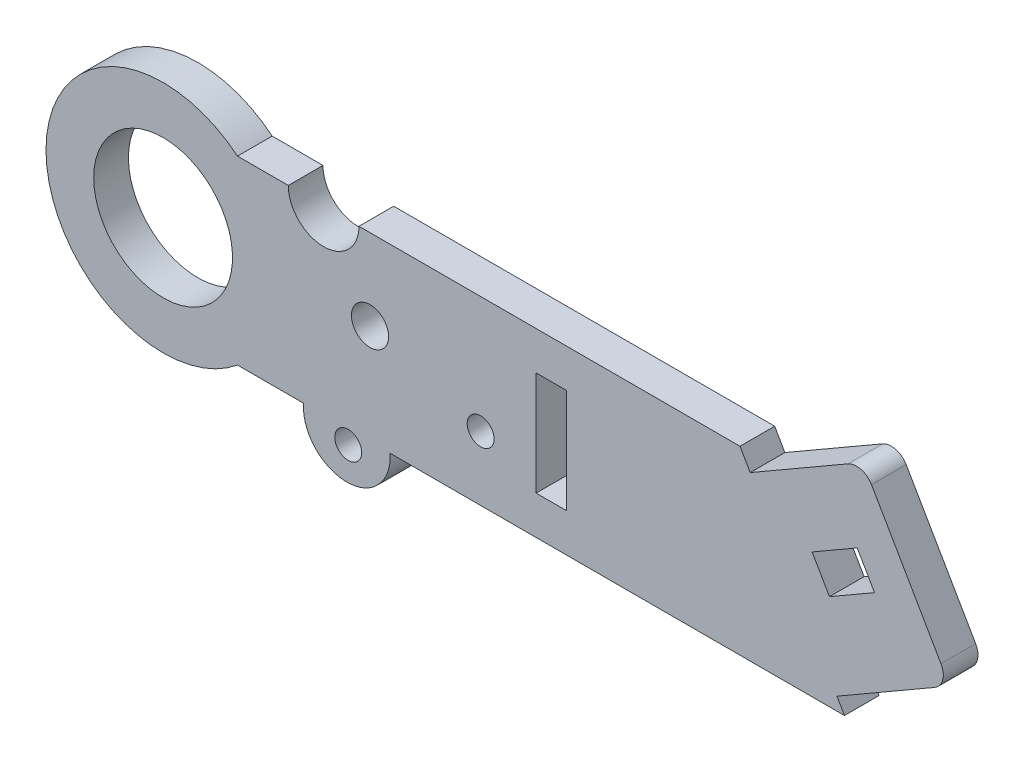
ISO-10303-21;
HEADER;
FILE_DESCRIPTION(('STEP AP214'),'2;1');
FILE_NAME('part.step','',(''),(''),'','','');
FILE_SCHEMA(('AUTOMOTIVE_DESIGN { 1 0 10303 214 1 1 1 1 }'));
ENDSEC;
DATA;
#1=APPLICATION_CONTEXT('core data for automotive mechanical design processes');
#2=APPLICATION_PROTOCOL_DEFINITION('international standard','automotive_design',2000,#1);
#3=PRODUCT_CONTEXT('',#1,'mechanical');
#4=PRODUCT('Part','Part','',(#3));
#5=PRODUCT_RELATED_PRODUCT_CATEGORY('part','',(#4));
#6=PRODUCT_DEFINITION_FORMATION('','',#4);
#7=PRODUCT_DEFINITION_CONTEXT('part definition',#1,'design');
#8=PRODUCT_DEFINITION('design','',#6,#7);
#9=PRODUCT_DEFINITION_SHAPE('','',#8);
#10=(LENGTH_UNIT() NAMED_UNIT(*) SI_UNIT(.MILLI.,.METRE.));
#11=(NAMED_UNIT(*) PLANE_ANGLE_UNIT() SI_UNIT($,.RADIAN.));
#12=(NAMED_UNIT(*) SI_UNIT($,.STERADIAN.) SOLID_ANGLE_UNIT());
#13=UNCERTAINTY_MEASURE_WITH_UNIT(LENGTH_MEASURE(1.E-05),#10,'distance_accuracy_value','');
#14=(GEOMETRIC_REPRESENTATION_CONTEXT(3) GLOBAL_UNCERTAINTY_ASSIGNED_CONTEXT((#13)) GLOBAL_UNIT_ASSIGNED_CONTEXT((#10,
#11,#12)) REPRESENTATION_CONTEXT('',''));
#15=CARTESIAN_POINT('',(0.,0.,0.));
#16=DIRECTION('',(0.,0.,1.));
#17=DIRECTION('',(1.,0.,0.));
#18=AXIS2_PLACEMENT_3D('',#15,#16,#17);
#19=CARTESIAN_POINT('',(8.57055073223616,-10.430515814004,4.));
#20=DIRECTION('',(0.,1.,0.));
#21=DIRECTION('',(0.,0.,1.));
#22=AXIS2_PLACEMENT_3D('',#19,#20,#21);
#23=PLANE('',#22);
#24=DIRECTION('',(1.,0.,0.));
#25=VECTOR('',#24,1.);
#26=CARTESIAN_POINT('',(8.57055073223616,-10.430515814004,0.));
#27=LINE('',#26,#25);
#28=CARTESIAN_POINT('',(-71.4294492677641,-10.4305158140037,0.));
#29=VERTEX_POINT('',#28);
#30=CARTESIAN_POINT('',(-63.8116781778458,-10.4305158140037,0.));
#31=VERTEX_POINT('',#30);
#32=EDGE_CURVE('E189',#29,#31,#27,.T.);
#33=ORIENTED_EDGE('',*,*,#32,.T.);
#34=DIRECTION('',(0.,0.,1.));
#35=VECTOR('',#34,1.);
#36=CARTESIAN_POINT('',(-63.8116781778458,-10.4305158140037,-11.3544340451003));
#37=LINE('',#36,#35);
#38=CARTESIAN_POINT('',(-63.8116781778458,-10.4305158140037,4.));
#39=VERTEX_POINT('',#38);
#40=EDGE_CURVE('E193',#31,#39,#37,.T.);
#41=ORIENTED_EDGE('',*,*,#40,.T.);
#42=DIRECTION('',(1.,0.,0.));
#43=VECTOR('',#42,1.);
#44=CARTESIAN_POINT('',(8.57055073223616,-10.430515814004,4.));
#45=LINE('',#44,#43);
#46=CARTESIAN_POINT('',(-71.4294492677641,-10.4305158140037,4.));
#47=VERTEX_POINT('',#46);
#48=EDGE_CURVE('E216',#47,#39,#45,.T.);
#49=ORIENTED_EDGE('',*,*,#48,.F.);
#50=DIRECTION('',(0.,0.,-1.));
#51=VECTOR('',#50,1.);
#52=CARTESIAN_POINT('',(-71.4294492677641,-10.4305158140037,4.));
#53=LINE('',#52,#51);
#54=EDGE_CURVE('E205',#47,#29,#53,.T.);
#55=ORIENTED_EDGE('',*,*,#54,.T.);
#56=EDGE_LOOP('',(#33,#41,#49,#55));
#57=FACE_BOUND('',#56,.T.);
#58=ADVANCED_FACE('F33',(#57),#23,.F.);
#59=CARTESIAN_POINT('',(8.57055073223616,-2.22044604925031E-13,4.));
#60=DIRECTION('',(0.,0.,-1.));
#61=DIRECTION('',(-1.,0.,0.));
#62=AXIS2_PLACEMENT_3D('',#59,#60,#61);
#63=PLANE('',#62);
#64=CARTESIAN_POINT('',(-58.6598475020388,-12.0125477342129,4.));
#65=DIRECTION('',(0.,0.,1.));
#66=DIRECTION('',(1.,0.,0.));
#67=AXIS2_PLACEMENT_3D('',#64,#65,#66);
#68=CIRCLE('',#67,1.54999999999853);
#69=CARTESIAN_POINT('',(-57.1098475020402,-12.0125477342129,4.));
#70=VERTEX_POINT('',#69);
#71=EDGE_CURVE('E222',#70,#70,#68,.T.);
#72=ORIENTED_EDGE('',*,*,#71,.F.);
#73=EDGE_LOOP('',(#72));
#74=FACE_BOUND('',#73,.T.);
#75=CARTESIAN_POINT('',(-43.3999999999984,-3.02505635917277,4.));
#76=DIRECTION('',(0.,0.,1.));
#77=DIRECTION('',(1.,0.,0.));
#78=AXIS2_PLACEMENT_3D('',#75,#76,#77);
#79=CIRCLE('',#78,1.54999999999853);
#80=CARTESIAN_POINT('',(-41.8499999999999,-3.02505635917277,4.));
#81=VERTEX_POINT('',#80);
#82=EDGE_CURVE('E227',#81,#81,#79,.T.);
#83=ORIENTED_EDGE('',*,*,#82,.F.);
#84=EDGE_LOOP('',(#83));
#85=FACE_BOUND('',#84,.T.);
#86=CARTESIAN_POINT('',(-80.,0.,4.));
#87=DIRECTION('',(0.,0.,-1.));
#88=DIRECTION('',(-1.,0.,0.));
#89=AXIS2_PLACEMENT_3D('',#86,#87,#88);
#90=CIRCLE('',#89,8.);
#91=CARTESIAN_POINT('',(-88.,0.,4.));
#92=VERTEX_POINT('',#91);
#93=EDGE_CURVE('E322',#92,#92,#90,.T.);
#94=ORIENTED_EDGE('',*,*,#93,.T.);
#95=EDGE_LOOP('',(#94));
#96=FACE_BOUND('',#95,.T.);
#97=DIRECTION('',(0.866025403784436,0.500000000000004,0.));
#98=VECTOR('',#97,1.);
#99=CARTESIAN_POINT('',(-5.19615242270663,4.03358580113404,4.));
#100=LINE('',#99,#98);
#101=CARTESIAN_POINT('',(-5.19615242270664,4.03358580113404,4.));
#102=VERTEX_POINT('',#101);
#103=CARTESIAN_POINT('',(0.,7.03358580113407,4.));
#104=VERTEX_POINT('',#103);
#105=EDGE_CURVE('E356',#102,#104,#100,.T.);
#106=ORIENTED_EDGE('',*,*,#105,.T.);
#107=DIRECTION('',(0.500000000000028,-0.866025403784423,0.));
#108=VECTOR('',#107,1.);
#109=CARTESIAN_POINT('',(0.,7.03358580113407,4.));
#110=LINE('',#109,#108);
#111=CARTESIAN_POINT('',(2.,3.56948418599654,4.));
#112=VERTEX_POINT('',#111);
#113=EDGE_CURVE('E353',#104,#112,#110,.T.);
#114=ORIENTED_EDGE('',*,*,#113,.T.);
#115=DIRECTION('',(0.86602540378442,0.500000000000032,0.));
#116=VECTOR('',#115,1.);
#117=CARTESIAN_POINT('',(-3.19615242270662,0.569484185996294,4.));
#118=LINE('',#117,#116);
#119=CARTESIAN_POINT('',(-3.19615242270662,0.569484185996294,4.));
#120=VERTEX_POINT('',#119);
#121=EDGE_CURVE('E350',#120,#112,#118,.T.);
#122=ORIENTED_EDGE('',*,*,#121,.F.);
#123=DIRECTION('',(0.500000000000004,-0.866025403784436,0.));
#124=VECTOR('',#123,1.);
#125=CARTESIAN_POINT('',(-5.19615242270663,4.03358580113404,4.));
#126=LINE('',#125,#124);
#127=EDGE_CURVE('E347',#102,#120,#126,.T.);
#128=ORIENTED_EDGE('',*,*,#127,.F.);
#129=EDGE_LOOP('',(#106,#114,#122,#128));
#130=FACE_BOUND('',#129,.T.);
#131=CARTESIAN_POINT('',(-56.1528243140113,1.10586946070457,4.));
#132=DIRECTION('',(0.,0.,1.));
#133=DIRECTION('',(1.,0.,0.));
#134=AXIS2_PLACEMENT_3D('',#131,#132,#133);
#135=CIRCLE('',#134,2.14132169694266);
#136=CARTESIAN_POINT('',(-54.0115026170686,1.10586946070457,4.));
#137=VERTEX_POINT('',#136);
#138=EDGE_CURVE('E332',#137,#137,#135,.T.);
#139=ORIENTED_EDGE('',*,*,#138,.F.);
#140=EDGE_LOOP('',(#139));
#141=FACE_BOUND('',#140,.T.);
#142=CARTESIAN_POINT('',(-0.0717013090071193,13.1579965718949,4.));
#143=DIRECTION('',(0.,0.,-1.));
#144=DIRECTION('',(-1.,0.,0.));
#145=AXIS2_PLACEMENT_3D('',#142,#143,#144);
#146=CIRCLE('',#145,2.);
#147=CARTESIAN_POINT('',(-1.07179676972452,14.8899922616853,4.));
#148=VERTEX_POINT('',#147);
#149=CARTESIAN_POINT('',(1.64975511933884,14.1761261143925,4.));
#150=VERTEX_POINT('',#149);
#151=EDGE_CURVE('E265',#148,#150,#146,.T.);
#152=ORIENTED_EDGE('',*,*,#151,.F.);
#153=DIRECTION('',(0.866025403784438,0.500000000000001,0.));
#154=VECTOR('',#153,1.);
#155=CARTESIAN_POINT('',(-1.07179676972452,14.8899922616853,4.));
#156=LINE('',#155,#154);
#157=CARTESIAN_POINT('',(-12.3301270189222,8.3899922616853,4.));
#158=VERTEX_POINT('',#157);
#159=EDGE_CURVE('E274',#158,#148,#156,.T.);
#160=ORIENTED_EDGE('',*,*,#159,.F.);
#161=DIRECTION('',(0.499999999999999,-0.866025403784439,0.));
#162=VECTOR('',#161,1.);
#163=CARTESIAN_POINT('',(-15.6303737032397,14.1061871964339,4.));
#164=LINE('',#163,#162);
#165=CARTESIAN_POINT('',(-13.5082238411409,10.4305158140035,4.));
#166=VERTEX_POINT('',#165);
#167=EDGE_CURVE('E317',#166,#158,#164,.T.);
#168=ORIENTED_EDGE('',*,*,#167,.F.);
#169=DIRECTION('',(-1.,0.,0.));
#170=VECTOR('',#169,1.);
#171=CARTESIAN_POINT('',(-57.4234990357641,10.4305158140035,4.));
#172=LINE('',#171,#170);
#173=CARTESIAN_POINT('',(-57.4234990357641,10.4305158140035,4.));
#174=VERTEX_POINT('',#173);
#175=EDGE_CURVE('E206',#166,#174,#172,.T.);
#176=ORIENTED_EDGE('',*,*,#175,.T.);
#177=CARTESIAN_POINT('',(-61.4993944199049,10.430515814004,4.));
#178=DIRECTION('',(0.,0.,-1.));
#179=DIRECTION('',(1.,0.,0.));
#180=AXIS2_PLACEMENT_3D('',#177,#178,#179);
#181=CIRCLE('',#180,4.07589538414074);
#182=CARTESIAN_POINT('',(-65.5752898040456,10.430515814004,4.));
#183=VERTEX_POINT('',#182);
#184=EDGE_CURVE('E208',#174,#183,#181,.T.);
#185=ORIENTED_EDGE('',*,*,#184,.T.);
#186=DIRECTION('',(-1.,0.,0.));
#187=VECTOR('',#186,1.);
#188=CARTESIAN_POINT('',(-71.4294492677638,10.430515814004,4.));
#189=LINE('',#188,#187);
#190=CARTESIAN_POINT('',(-71.4294492677638,10.430515814004,4.));
#191=VERTEX_POINT('',#190);
#192=EDGE_CURVE('E366',#183,#191,#189,.T.);
#193=ORIENTED_EDGE('',*,*,#192,.T.);
#194=CARTESIAN_POINT('',(-80.0000000000002,4.8919202022546E-13,4.));
#195=DIRECTION('',(0.,0.,1.));
#196=DIRECTION('',(1.,0.,0.));
#197=AXIS2_PLACEMENT_3D('',#194,#195,#196);
#198=CIRCLE('',#197,13.5000000000009);
#199=EDGE_CURVE('E368',#191,#47,#198,.T.);
#200=ORIENTED_EDGE('',*,*,#199,.T.);
#201=ORIENTED_EDGE('',*,*,#48,.T.);
#202=CARTESIAN_POINT('',(-58.8259890857738,-10.8085426347376,4.));
#203=DIRECTION('',(0.,0.,1.));
#204=DIRECTION('',(1.,0.,0.));
#205=AXIS2_PLACEMENT_3D('',#202,#203,#204);
#206=CIRCLE('',#205,5.);
#207=CARTESIAN_POINT('',(-53.8402999937018,-10.4305158140037,4.));
#208=VERTEX_POINT('',#207);
#209=EDGE_CURVE('E198',#39,#208,#206,.T.);
#210=ORIENTED_EDGE('',*,*,#209,.T.);
#211=CARTESIAN_POINT('',(-1.46410161513748,-10.430515814004,4.));
#212=VERTEX_POINT('',#211);
#213=EDGE_CURVE('E370',#208,#212,#45,.T.);
#214=ORIENTED_EDGE('',*,*,#213,.T.);
#215=DIRECTION('',(0.5,-0.866025403784439,0.));
#216=VECTOR('',#215,1.);
#217=CARTESIAN_POINT('',(-2.33012701892221,-8.93051581400346,4.));
#218=LINE('',#217,#216);
#219=CARTESIAN_POINT('',(-2.33012701892221,-8.93051581400346,4.));
#220=VERTEX_POINT('',#219);
#221=EDGE_CURVE('E301',#220,#212,#218,.T.);
#222=ORIENTED_EDGE('',*,*,#221,.F.);
#223=DIRECTION('',(-0.866025403784438,-0.5,0.));
#224=VECTOR('',#223,1.);
#225=CARTESIAN_POINT('',(-2.33012701892221,-8.93051581400346,4.));
#226=LINE('',#225,#224);
#227=CARTESIAN_POINT('',(8.92820323027549,-2.43051581400346,4.));
#228=VERTEX_POINT('',#227);
#229=EDGE_CURVE('E298',#228,#220,#226,.T.);
#230=ORIENTED_EDGE('',*,*,#229,.F.);
#231=CARTESIAN_POINT('',(7.92820323027598,-0.6984650064343,4.));
#232=DIRECTION('',(0.,0.,-1.));
#233=DIRECTION('',(-1.,0.,0.));
#234=AXIS2_PLACEMENT_3D('',#231,#232,#233);
#235=CIRCLE('',#234,2.);
#236=CARTESIAN_POINT('',(9.66025478960577,0.301533691476469,4.));
#237=VERTEX_POINT('',#236);
#238=EDGE_CURVE('E272',#237,#228,#235,.T.);
#239=ORIENTED_EDGE('',*,*,#238,.F.);
#240=DIRECTION('',(0.5,-0.866025403784439,0.));
#241=VECTOR('',#240,1.);
#242=CARTESIAN_POINT('',(1.64975511933884,14.1761261143925,4.));
#243=LINE('',#242,#241);
#244=EDGE_CURVE('E268',#150,#237,#243,.T.);
#245=ORIENTED_EDGE('',*,*,#244,.F.);
#246=EDGE_LOOP('',(#152,#160,#168,#176,#185,#193,#200,#201,#210,#214,#222,#230,#239,#245));
#247=FACE_BOUND('',#246,.T.);
#248=DIRECTION('',(1.,0.,0.));
#249=VECTOR('',#248,1.);
#250=CARTESIAN_POINT('',(-37.008223841141,5.99999999999992,4.));
#251=LINE('',#250,#249);
#252=CARTESIAN_POINT('',(-37.008223841141,5.99999999999992,4.));
#253=VERTEX_POINT('',#252);
#254=CARTESIAN_POINT('',(-33.508223841141,6.00000000000007,4.));
#255=VERTEX_POINT('',#254);
#256=EDGE_CURVE('E58',#253,#255,#251,.T.);
#257=ORIENTED_EDGE('',*,*,#256,.T.);
#258=DIRECTION('',(0.,-1.,0.));
#259=VECTOR('',#258,1.);
#260=CARTESIAN_POINT('',(-33.508223841141,6.00000000000007,4.));
#261=LINE('',#260,#259);
#262=CARTESIAN_POINT('',(-33.508223841141,-5.99999999999993,4.));
#263=VERTEX_POINT('',#262);
#264=EDGE_CURVE('E244',#255,#263,#261,.T.);
#265=ORIENTED_EDGE('',*,*,#264,.T.);
#266=DIRECTION('',(1.,0.,0.));
#267=VECTOR('',#266,1.);
#268=CARTESIAN_POINT('',(-37.008223841141,-6.00000000000008,4.));
#269=LINE('',#268,#267);
#270=CARTESIAN_POINT('',(-37.008223841141,-6.00000000000008,4.));
#271=VERTEX_POINT('',#270);
#272=EDGE_CURVE('E247',#271,#263,#269,.T.);
#273=ORIENTED_EDGE('',*,*,#272,.F.);
#274=DIRECTION('',(0.,-1.,0.));
#275=VECTOR('',#274,1.);
#276=CARTESIAN_POINT('',(-37.008223841141,5.99999999999992,4.));
#277=LINE('',#276,#275);
#278=EDGE_CURVE('E250',#253,#271,#277,.T.);
#279=ORIENTED_EDGE('',*,*,#278,.F.);
#280=EDGE_LOOP('',(#257,#265,#273,#279));
#281=FACE_BOUND('',#280,.T.);
#282=ADVANCED_FACE('F392',(#74,#85,#96,#130,#141,#247,#281),#63,.F.);
#283=CARTESIAN_POINT('',(8.57055073223616,-2.22044604925031E-13,0.));
#284=DIRECTION('',(0.,0.,-1.));
#285=DIRECTION('',(-1.,0.,0.));
#286=AXIS2_PLACEMENT_3D('',#283,#284,#285);
#287=PLANE('',#286);
#288=CARTESIAN_POINT('',(-58.6598475020388,-12.0125477342129,0.));
#289=DIRECTION('',(0.,0.,-1.));
#290=DIRECTION('',(-1.,0.,0.));
#291=AXIS2_PLACEMENT_3D('',#288,#289,#290);
#292=CIRCLE('',#291,1.54999999999853);
#293=CARTESIAN_POINT('',(-60.2098475020373,-12.0125477342129,0.));
#294=VERTEX_POINT('',#293);
#295=EDGE_CURVE('E37',#294,#294,#292,.T.);
#296=ORIENTED_EDGE('',*,*,#295,.F.);
#297=EDGE_LOOP('',(#296));
#298=FACE_BOUND('',#297,.T.);
#299=CARTESIAN_POINT('',(-43.3999999999984,-3.02505635917277,0.));
#300=DIRECTION('',(0.,0.,-1.));
#301=DIRECTION('',(-1.,0.,0.));
#302=AXIS2_PLACEMENT_3D('',#299,#300,#301);
#303=CIRCLE('',#302,1.54999999999853);
#304=CARTESIAN_POINT('',(-44.9499999999969,-3.02505635917277,0.));
#305=VERTEX_POINT('',#304);
#306=EDGE_CURVE('E220',#305,#305,#303,.T.);
#307=ORIENTED_EDGE('',*,*,#306,.F.);
#308=EDGE_LOOP('',(#307));
#309=FACE_BOUND('',#308,.T.);
#310=DIRECTION('',(0.866025403784438,0.500000000000001,0.));
#311=VECTOR('',#310,1.);
#312=CARTESIAN_POINT('',(-1.07179676972452,14.8899922616853,0.));
#313=LINE('',#312,#311);
#314=CARTESIAN_POINT('',(-12.3301270189222,8.3899922616853,0.));
#315=VERTEX_POINT('',#314);
#316=CARTESIAN_POINT('',(-1.07179676972452,14.8899922616853,0.));
#317=VERTEX_POINT('',#316);
#318=EDGE_CURVE('E314',#315,#317,#313,.T.);
#319=ORIENTED_EDGE('',*,*,#318,.T.);
#320=CARTESIAN_POINT('',(-0.0717013090071193,13.1579965718949,0.));
#321=DIRECTION('',(0.,0.,1.));
#322=DIRECTION('',(-1.,0.,0.));
#323=AXIS2_PLACEMENT_3D('',#320,#321,#322);
#324=CIRCLE('',#323,2.);
#325=CARTESIAN_POINT('',(1.64975511933884,14.1761261143925,0.));
#326=VERTEX_POINT('',#325);
#327=EDGE_CURVE('E280',#326,#317,#324,.T.);
#328=ORIENTED_EDGE('',*,*,#327,.F.);
#329=DIRECTION('',(-0.5,0.866025403784439,0.));
#330=VECTOR('',#329,1.);
#331=CARTESIAN_POINT('',(1.64975511933884,14.1761261143925,0.));
#332=LINE('',#331,#330);
#333=CARTESIAN_POINT('',(9.66025478960577,0.30153369147647,0.));
#334=VERTEX_POINT('',#333);
#335=EDGE_CURVE('E277',#334,#326,#332,.T.);
#336=ORIENTED_EDGE('',*,*,#335,.F.);
#337=CARTESIAN_POINT('',(7.92820323027598,-0.6984650064343,0.));
#338=DIRECTION('',(0.,0.,1.));
#339=DIRECTION('',(1.,0.,0.));
#340=AXIS2_PLACEMENT_3D('',#337,#338,#339);
#341=CIRCLE('',#340,2.);
#342=CARTESIAN_POINT('',(8.92820323027549,-2.43051581400346,0.));
#343=VERTEX_POINT('',#342);
#344=EDGE_CURVE('E264',#343,#334,#341,.T.);
#345=ORIENTED_EDGE('',*,*,#344,.F.);
#346=DIRECTION('',(-0.866025403784439,-0.5,0.));
#347=VECTOR('',#346,1.);
#348=CARTESIAN_POINT('',(-2.33012701892221,-8.93051581400346,0.));
#349=LINE('',#348,#347);
#350=CARTESIAN_POINT('',(-2.33012701892221,-8.93051581400346,0.));
#351=VERTEX_POINT('',#350);
#352=EDGE_CURVE('E292',#343,#351,#349,.T.);
#353=ORIENTED_EDGE('',*,*,#352,.T.);
#354=DIRECTION('',(0.5,-0.866025403784439,0.));
#355=VECTOR('',#354,1.);
#356=CARTESIAN_POINT('',(-2.33012701892221,-8.93051581400346,0.));
#357=LINE('',#356,#355);
#358=CARTESIAN_POINT('',(-1.46410161513748,-10.430515814004,0.));
#359=VERTEX_POINT('',#358);
#360=EDGE_CURVE('E296',#351,#359,#357,.T.);
#361=ORIENTED_EDGE('',*,*,#360,.T.);
#362=CARTESIAN_POINT('',(-53.8402999937018,-10.430515814004,0.));
#363=VERTEX_POINT('',#362);
#364=EDGE_CURVE('E191',#363,#359,#27,.T.);
#365=ORIENTED_EDGE('',*,*,#364,.F.);
#366=CARTESIAN_POINT('',(-58.8259890857738,-10.8085426347376,0.));
#367=DIRECTION('',(0.,0.,-1.));
#368=DIRECTION('',(-1.,0.,0.));
#369=AXIS2_PLACEMENT_3D('',#366,#367,#368);
#370=CIRCLE('',#369,5.);
#371=EDGE_CURVE('E50',#31,#363,#370,.F.);
#372=ORIENTED_EDGE('',*,*,#371,.F.);
#373=ORIENTED_EDGE('',*,*,#32,.F.);
#374=CARTESIAN_POINT('',(-80.0000000000002,4.8919202022546E-13,0.));
#375=DIRECTION('',(0.,0.,1.));
#376=DIRECTION('',(1.,0.,0.));
#377=AXIS2_PLACEMENT_3D('',#374,#375,#376);
#378=CIRCLE('',#377,13.5000000000009);
#379=CARTESIAN_POINT('',(-71.4294492677638,10.430515814004,0.));
#380=VERTEX_POINT('',#379);
#381=EDGE_CURVE('E210',#380,#29,#378,.T.);
#382=ORIENTED_EDGE('',*,*,#381,.F.);
#383=DIRECTION('',(-1.,0.,0.));
#384=VECTOR('',#383,1.);
#385=CARTESIAN_POINT('',(-71.4294492677638,10.430515814004,0.));
#386=LINE('',#385,#384);
#387=CARTESIAN_POINT('',(-65.5752898040456,10.430515814004,0.));
#388=VERTEX_POINT('',#387);
#389=EDGE_CURVE('E374',#388,#380,#386,.T.);
#390=ORIENTED_EDGE('',*,*,#389,.F.);
#391=CARTESIAN_POINT('',(-61.4993944199049,10.430515814004,0.));
#392=DIRECTION('',(0.,0.,-1.));
#393=DIRECTION('',(1.,0.,0.));
#394=AXIS2_PLACEMENT_3D('',#391,#392,#393);
#395=CIRCLE('',#394,4.07589538414074);
#396=CARTESIAN_POINT('',(-57.4234990357641,10.4305158140035,0.));
#397=VERTEX_POINT('',#396);
#398=EDGE_CURVE('E373',#397,#388,#395,.T.);
#399=ORIENTED_EDGE('',*,*,#398,.F.);
#400=DIRECTION('',(-1.,0.,0.));
#401=VECTOR('',#400,1.);
#402=CARTESIAN_POINT('',(-57.4234990357641,10.4305158140035,0.));
#403=LINE('',#402,#401);
#404=CARTESIAN_POINT('',(-13.5082238411409,10.4305158140035,0.));
#405=VERTEX_POINT('',#404);
#406=EDGE_CURVE('E329',#405,#397,#403,.T.);
#407=ORIENTED_EDGE('',*,*,#406,.F.);
#408=DIRECTION('',(0.499999999999999,-0.866025403784439,0.));
#409=VECTOR('',#408,1.);
#410=CARTESIAN_POINT('',(-15.6303737032397,14.1061871964339,0.));
#411=LINE('',#410,#409);
#412=EDGE_CURVE('E310',#405,#315,#411,.T.);
#413=ORIENTED_EDGE('',*,*,#412,.T.);
#414=EDGE_LOOP('',(#319,#328,#336,#345,#353,#361,#365,#372,#373,#382,#390,#399,#407,#413));
#415=FACE_BOUND('',#414,.T.);
#416=DIRECTION('',(0.500000000000028,-0.866025403784423,0.));
#417=VECTOR('',#416,1.);
#418=CARTESIAN_POINT('',(0.,7.03358580113407,0.));
#419=LINE('',#418,#417);
#420=CARTESIAN_POINT('',(0.,7.03358580113407,0.));
#421=VERTEX_POINT('',#420);
#422=CARTESIAN_POINT('',(2.,3.56948418599654,0.));
#423=VERTEX_POINT('',#422);
#424=EDGE_CURVE('E361',#421,#423,#419,.T.);
#425=ORIENTED_EDGE('',*,*,#424,.F.);
#426=DIRECTION('',(0.866025403784436,0.500000000000004,0.));
#427=VECTOR('',#426,1.);
#428=CARTESIAN_POINT('',(-5.19615242270663,4.03358580113404,0.));
#429=LINE('',#428,#427);
#430=CARTESIAN_POINT('',(-5.19615242270663,4.03358580113404,0.));
#431=VERTEX_POINT('',#430);
#432=EDGE_CURVE('E359',#431,#421,#429,.T.);
#433=ORIENTED_EDGE('',*,*,#432,.F.);
#434=DIRECTION('',(0.500000000000004,-0.866025403784436,0.));
#435=VECTOR('',#434,1.);
#436=CARTESIAN_POINT('',(-5.19615242270663,4.03358580113404,0.));
#437=LINE('',#436,#435);
#438=CARTESIAN_POINT('',(-3.19615242270662,0.569484185996295,0.));
#439=VERTEX_POINT('',#438);
#440=EDGE_CURVE('E307',#431,#439,#437,.T.);
#441=ORIENTED_EDGE('',*,*,#440,.T.);
#442=DIRECTION('',(0.86602540378442,0.500000000000032,0.));
#443=VECTOR('',#442,1.);
#444=CARTESIAN_POINT('',(-3.19615242270662,0.569484185996294,0.));
#445=LINE('',#444,#443);
#446=EDGE_CURVE('E335',#439,#423,#445,.T.);
#447=ORIENTED_EDGE('',*,*,#446,.T.);
#448=EDGE_LOOP('',(#425,#433,#441,#447));
#449=FACE_BOUND('',#448,.T.);
#450=CARTESIAN_POINT('',(-56.1528243140113,1.10586946070457,0.));
#451=DIRECTION('',(0.,0.,-1.));
#452=DIRECTION('',(-1.,0.,0.));
#453=AXIS2_PLACEMENT_3D('',#450,#451,#452);
#454=CIRCLE('',#453,2.14132169694266);
#455=CARTESIAN_POINT('',(-58.294146010954,1.10586946070457,0.));
#456=VERTEX_POINT('',#455);
#457=EDGE_CURVE('E326',#456,#456,#454,.F.);
#458=ORIENTED_EDGE('',*,*,#457,.T.);
#459=EDGE_LOOP('',(#458));
#460=FACE_BOUND('',#459,.T.);
#461=CARTESIAN_POINT('',(-80.,0.,0.));
#462=DIRECTION('',(0.,0.,-1.));
#463=DIRECTION('',(-1.,0.,0.));
#464=AXIS2_PLACEMENT_3D('',#461,#462,#463);
#465=CIRCLE('',#464,8.);
#466=CARTESIAN_POINT('',(-88.,0.,0.));
#467=VERTEX_POINT('',#466);
#468=EDGE_CURVE('E325',#467,#467,#465,.T.);
#469=ORIENTED_EDGE('',*,*,#468,.F.);
#470=EDGE_LOOP('',(#469));
#471=FACE_BOUND('',#470,.T.);
#472=DIRECTION('',(0.,-1.,0.));
#473=VECTOR('',#472,1.);
#474=CARTESIAN_POINT('',(-33.508223841141,6.00000000000007,0.));
#475=LINE('',#474,#473);
#476=CARTESIAN_POINT('',(-33.508223841141,6.00000000000007,0.));
#477=VERTEX_POINT('',#476);
#478=CARTESIAN_POINT('',(-33.508223841141,-5.99999999999993,0.));
#479=VERTEX_POINT('',#478);
#480=EDGE_CURVE('E239',#477,#479,#475,.T.);
#481=ORIENTED_EDGE('',*,*,#480,.F.);
#482=DIRECTION('',(1.,0.,0.));
#483=VECTOR('',#482,1.);
#484=CARTESIAN_POINT('',(-37.008223841141,5.99999999999992,0.));
#485=LINE('',#484,#483);
#486=CARTESIAN_POINT('',(-37.008223841141,5.99999999999992,0.));
#487=VERTEX_POINT('',#486);
#488=EDGE_CURVE('E241',#487,#477,#485,.T.);
#489=ORIENTED_EDGE('',*,*,#488,.F.);
#490=DIRECTION('',(0.,-1.,0.));
#491=VECTOR('',#490,1.);
#492=CARTESIAN_POINT('',(-37.008223841141,5.99999999999992,0.));
#493=LINE('',#492,#491);
#494=CARTESIAN_POINT('',(-37.008223841141,-6.00000000000008,0.));
#495=VERTEX_POINT('',#494);
#496=EDGE_CURVE('E261',#487,#495,#493,.T.);
#497=ORIENTED_EDGE('',*,*,#496,.T.);
#498=DIRECTION('',(1.,0.,0.));
#499=VECTOR('',#498,1.);
#500=CARTESIAN_POINT('',(-37.008223841141,-6.00000000000008,0.));
#501=LINE('',#500,#499);
#502=EDGE_CURVE('E236',#495,#479,#501,.T.);
#503=ORIENTED_EDGE('',*,*,#502,.T.);
#504=EDGE_LOOP('',(#481,#489,#497,#503));
#505=FACE_BOUND('',#504,.T.);
#506=ADVANCED_FACE('F185',(#298,#309,#415,#449,#460,#471,#505),#287,.T.);
#507=CARTESIAN_POINT('',(-57.4234990357641,10.4305158140035,4.));
#508=DIRECTION('',(0.,-1.,0.));
#509=DIRECTION('',(1.,0.,0.));
#510=AXIS2_PLACEMENT_3D('',#507,#508,#509);
#511=PLANE('',#510);
#512=ORIENTED_EDGE('',*,*,#175,.F.);
#513=DIRECTION('',(0.,0.,1.));
#514=VECTOR('',#513,1.);
#515=CARTESIAN_POINT('',(-13.5082238411409,10.4305158140035,-0.00100000000000013));
#516=LINE('',#515,#514);
#517=EDGE_CURVE('E293',#405,#166,#516,.T.);
#518=ORIENTED_EDGE('',*,*,#517,.F.);
#519=ORIENTED_EDGE('',*,*,#406,.T.);
#520=DIRECTION('',(0.,0.,-1.));
#521=VECTOR('',#520,1.);
#522=CARTESIAN_POINT('',(-57.4234990357641,10.4305158140035,4.));
#523=LINE('',#522,#521);
#524=EDGE_CURVE('E11',#174,#397,#523,.T.);
#525=ORIENTED_EDGE('',*,*,#524,.F.);
#526=EDGE_LOOP('',(#512,#518,#519,#525));
#527=FACE_BOUND('',#526,.T.);
#528=ADVANCED_FACE('F35',(#527),#511,.F.);
#529=CARTESIAN_POINT('',(-61.4993944199049,10.430515814004,4.));
#530=DIRECTION('',(0.,0.,-1.));
#531=DIRECTION('',(-1.,0.,0.));
#532=AXIS2_PLACEMENT_3D('',#529,#530,#531);
#533=CYLINDRICAL_SURFACE('',#532,4.07589538414074);
#534=ORIENTED_EDGE('',*,*,#398,.T.);
#535=DIRECTION('',(0.,0.,-1.));
#536=VECTOR('',#535,1.);
#537=CARTESIAN_POINT('',(-65.5752898040456,10.430515814004,4.));
#538=LINE('',#537,#536);
#539=EDGE_CURVE('E42',#183,#388,#538,.T.);
#540=ORIENTED_EDGE('',*,*,#539,.F.);
#541=ORIENTED_EDGE('',*,*,#184,.F.);
#542=ORIENTED_EDGE('',*,*,#524,.T.);
#543=EDGE_LOOP('',(#534,#540,#541,#542));
#544=FACE_BOUND('',#543,.T.);
#545=ADVANCED_FACE('F385',(#544),#533,.F.);
#546=CARTESIAN_POINT('',(-71.4294492677638,10.430515814004,4.));
#547=DIRECTION('',(0.,-1.,0.));
#548=DIRECTION('',(1.,0.,0.));
#549=AXIS2_PLACEMENT_3D('',#546,#547,#548);
#550=PLANE('',#549);
#551=ORIENTED_EDGE('',*,*,#389,.T.);
#552=DIRECTION('',(0.,0.,-1.));
#553=VECTOR('',#552,1.);
#554=CARTESIAN_POINT('',(-71.4294492677638,10.430515814004,4.));
#555=LINE('',#554,#553);
#556=EDGE_CURVE('E215',#191,#380,#555,.T.);
#557=ORIENTED_EDGE('',*,*,#556,.F.);
#558=ORIENTED_EDGE('',*,*,#192,.F.);
#559=ORIENTED_EDGE('',*,*,#539,.T.);
#560=EDGE_LOOP('',(#551,#557,#558,#559));
#561=FACE_BOUND('',#560,.T.);
#562=ADVANCED_FACE('F389',(#561),#550,.F.);
#563=CARTESIAN_POINT('',(-80.0000000000002,4.8919202022546E-13,4.));
#564=DIRECTION('',(0.,0.,-1.));
#565=DIRECTION('',(-1.,0.,0.));
#566=AXIS2_PLACEMENT_3D('',#563,#564,#565);
#567=CYLINDRICAL_SURFACE('',#566,13.5000000000009);
#568=ORIENTED_EDGE('',*,*,#381,.T.);
#569=ORIENTED_EDGE('',*,*,#54,.F.);
#570=ORIENTED_EDGE('',*,*,#199,.F.);
#571=ORIENTED_EDGE('',*,*,#556,.T.);
#572=EDGE_LOOP('',(#568,#569,#570,#571));
#573=FACE_BOUND('',#572,.T.);
#574=ADVANCED_FACE('F379',(#573),#567,.T.);
#575=ORIENTED_EDGE('',*,*,#213,.F.);
#576=DIRECTION('',(0.,0.,1.));
#577=VECTOR('',#576,1.);
#578=CARTESIAN_POINT('',(-53.8402999937018,-10.4305158140037,-11.3544340451003));
#579=LINE('',#578,#577);
#580=EDGE_CURVE('E192',#363,#208,#579,.T.);
#581=ORIENTED_EDGE('',*,*,#580,.F.);
#582=ORIENTED_EDGE('',*,*,#364,.T.);
#583=DIRECTION('',(0.,0.,-1.));
#584=VECTOR('',#583,1.);
#585=CARTESIAN_POINT('',(-1.46410161513748,-10.430515814004,-0.00100000000000013));
#586=LINE('',#585,#584);
#587=EDGE_CURVE('E289',#212,#359,#586,.T.);
#588=ORIENTED_EDGE('',*,*,#587,.F.);
#589=EDGE_LOOP('',(#575,#581,#582,#588));
#590=FACE_BOUND('',#589,.T.);
#591=ADVANCED_FACE('F426',(#590),#23,.F.);
#592=CARTESIAN_POINT('',(-5.19615242270663,4.03358580113404,-0.00100000000000013));
#593=DIRECTION('',(0.500000000000004,-0.866025403784436,0.));
#594=DIRECTION('',(0.866025403784436,0.500000000000004,0.));
#595=AXIS2_PLACEMENT_3D('',#592,#593,#594);
#596=PLANE('',#595);
#597=ORIENTED_EDGE('',*,*,#432,.T.);
#598=DIRECTION('',(0.,0.,1.));
#599=VECTOR('',#598,1.);
#600=CARTESIAN_POINT('',(0.,7.03358580113407,-0.00100000000000013));
#601=LINE('',#600,#599);
#602=EDGE_CURVE('E338',#421,#104,#601,.T.);
#603=ORIENTED_EDGE('',*,*,#602,.T.);
#604=ORIENTED_EDGE('',*,*,#105,.F.);
#605=DIRECTION('',(0.,0.,1.));
#606=VECTOR('',#605,1.);
#607=CARTESIAN_POINT('',(-5.19615242270663,4.03358580113404,-0.00100000000000013));
#608=LINE('',#607,#606);
#609=EDGE_CURVE('E344',#431,#102,#608,.T.);
#610=ORIENTED_EDGE('',*,*,#609,.F.);
#611=EDGE_LOOP('',(#597,#603,#604,#610));
#612=FACE_BOUND('',#611,.T.);
#613=ADVANCED_FACE('F449',(#612),#596,.T.);
#614=CARTESIAN_POINT('',(0.,7.03358580113407,-0.00100000000000013));
#615=DIRECTION('',(-0.866025403784423,-0.500000000000028,0.));
#616=DIRECTION('',(0.500000000000028,-0.866025403784423,0.));
#617=AXIS2_PLACEMENT_3D('',#614,#615,#616);
#618=PLANE('',#617);
#619=ORIENTED_EDGE('',*,*,#424,.T.);
#620=DIRECTION('',(0.,0.,1.));
#621=VECTOR('',#620,1.);
#622=CARTESIAN_POINT('',(2.,3.56948418599654,-0.00100000000000013));
#623=LINE('',#622,#621);
#624=EDGE_CURVE('E340',#423,#112,#623,.T.);
#625=ORIENTED_EDGE('',*,*,#624,.T.);
#626=ORIENTED_EDGE('',*,*,#113,.F.);
#627=ORIENTED_EDGE('',*,*,#602,.F.);
#628=EDGE_LOOP('',(#619,#625,#626,#627));
#629=FACE_BOUND('',#628,.T.);
#630=ADVANCED_FACE('F454',(#629),#618,.T.);
#631=CARTESIAN_POINT('',(-3.19615242270662,0.569484185996294,-0.00100000000000013));
#632=DIRECTION('',(0.500000000000032,-0.86602540378442,0.));
#633=DIRECTION('',(0.86602540378442,0.500000000000032,0.));
#634=AXIS2_PLACEMENT_3D('',#631,#632,#633);
#635=PLANE('',#634);
#636=DIRECTION('',(0.,0.,1.));
#637=VECTOR('',#636,1.);
#638=CARTESIAN_POINT('',(-3.19615242270662,0.569484185996294,-0.00100000000000013));
#639=LINE('',#638,#637);
#640=EDGE_CURVE('E342',#439,#120,#639,.T.);
#641=ORIENTED_EDGE('',*,*,#640,.T.);
#642=ORIENTED_EDGE('',*,*,#121,.T.);
#643=ORIENTED_EDGE('',*,*,#624,.F.);
#644=ORIENTED_EDGE('',*,*,#446,.F.);
#645=EDGE_LOOP('',(#641,#642,#643,#644));
#646=FACE_BOUND('',#645,.T.);
#647=ADVANCED_FACE('F478',(#646),#635,.F.);
#648=CARTESIAN_POINT('',(-5.19615242270663,4.03358580113404,-0.00100000000000013));
#649=DIRECTION('',(-0.866025403784436,-0.500000000000004,0.));
#650=DIRECTION('',(0.500000000000004,-0.866025403784436,0.));
#651=AXIS2_PLACEMENT_3D('',#648,#649,#650);
#652=PLANE('',#651);
#653=ORIENTED_EDGE('',*,*,#609,.T.);
#654=ORIENTED_EDGE('',*,*,#127,.T.);
#655=ORIENTED_EDGE('',*,*,#640,.F.);
#656=ORIENTED_EDGE('',*,*,#440,.F.);
#657=EDGE_LOOP('',(#653,#654,#655,#656));
#658=FACE_BOUND('',#657,.T.);
#659=ADVANCED_FACE('F474',(#658),#652,.F.);
#660=CARTESIAN_POINT('',(-56.1528243140113,1.10586946070457,-0.00100000000000013));
#661=DIRECTION('',(0.,0.,1.));
#662=DIRECTION('',(1.,0.,0.));
#663=AXIS2_PLACEMENT_3D('',#660,#661,#662);
#664=CYLINDRICAL_SURFACE('',#663,2.14132169694266);
#665=ORIENTED_EDGE('',*,*,#457,.F.);
#666=EDGE_LOOP('',(#665));
#667=FACE_BOUND('',#666,.T.);
#668=ORIENTED_EDGE('',*,*,#138,.T.);
#669=EDGE_LOOP('',(#668));
#670=FACE_BOUND('',#669,.T.);
#671=ADVANCED_FACE('F477',(#667,#670),#664,.F.);
#672=CARTESIAN_POINT('',(-80.,0.,-0.00100000000000013));
#673=DIRECTION('',(0.,0.,1.));
#674=DIRECTION('',(1.,0.,0.));
#675=AXIS2_PLACEMENT_3D('',#672,#673,#674);
#676=CYLINDRICAL_SURFACE('',#675,8.);
#677=ORIENTED_EDGE('',*,*,#468,.T.);
#678=EDGE_LOOP('',(#677));
#679=FACE_BOUND('',#678,.T.);
#680=ORIENTED_EDGE('',*,*,#93,.F.);
#681=EDGE_LOOP('',(#680));
#682=FACE_BOUND('',#681,.T.);
#683=ADVANCED_FACE('F488',(#679,#682),#676,.F.);
#684=CARTESIAN_POINT('',(-2.33012701892221,-8.93051581400346,-0.00100000000000013));
#685=DIRECTION('',(-0.5,0.866025403784438,0.));
#686=DIRECTION('',(-0.866025403784439,-0.5,0.));
#687=AXIS2_PLACEMENT_3D('',#684,#685,#686);
#688=PLANE('',#687);
#689=DIRECTION('',(0.,0.,1.));
#690=VECTOR('',#689,1.);
#691=CARTESIAN_POINT('',(8.92820323027549,-2.43051581400346,-0.00100000000000013));
#692=LINE('',#691,#690);
#693=EDGE_CURVE('E304',#343,#228,#692,.T.);
#694=ORIENTED_EDGE('',*,*,#693,.T.);
#695=ORIENTED_EDGE('',*,*,#229,.T.);
#696=DIRECTION('',(0.,0.,1.));
#697=VECTOR('',#696,1.);
#698=CARTESIAN_POINT('',(-2.33012701892221,-8.93051581400346,-0.00100000000000013));
#699=LINE('',#698,#697);
#700=EDGE_CURVE('E305',#351,#220,#699,.T.);
#701=ORIENTED_EDGE('',*,*,#700,.F.);
#702=ORIENTED_EDGE('',*,*,#352,.F.);
#703=EDGE_LOOP('',(#694,#695,#701,#702));
#704=FACE_BOUND('',#703,.T.);
#705=ADVANCED_FACE('F418',(#704),#688,.F.);
#706=CARTESIAN_POINT('',(-2.33012701892221,-8.93051581400346,-0.00100000000000013));
#707=DIRECTION('',(-0.866025403784439,-0.5,0.));
#708=DIRECTION('',(0.5,-0.866025403784439,0.));
#709=AXIS2_PLACEMENT_3D('',#706,#707,#708);
#710=PLANE('',#709);
#711=ORIENTED_EDGE('',*,*,#700,.T.);
#712=ORIENTED_EDGE('',*,*,#221,.T.);
#713=ORIENTED_EDGE('',*,*,#587,.T.);
#714=ORIENTED_EDGE('',*,*,#360,.F.);
#715=EDGE_LOOP('',(#711,#712,#713,#714));
#716=FACE_BOUND('',#715,.T.);
#717=ADVANCED_FACE('F422',(#716),#710,.F.);
#718=CARTESIAN_POINT('',(-1.07179676972452,14.8899922616853,-0.00100000000000013));
#719=DIRECTION('',(0.500000000000001,-0.866025403784438,0.));
#720=DIRECTION('',(0.866025403784438,0.500000000000001,0.));
#721=AXIS2_PLACEMENT_3D('',#718,#719,#720);
#722=PLANE('',#721);
#723=DIRECTION('',(0.,0.,1.));
#724=VECTOR('',#723,1.);
#725=CARTESIAN_POINT('',(-12.3301270189222,8.3899922616853,-0.00100000000000013));
#726=LINE('',#725,#724);
#727=EDGE_CURVE('E313',#315,#158,#726,.T.);
#728=ORIENTED_EDGE('',*,*,#727,.T.);
#729=ORIENTED_EDGE('',*,*,#159,.T.);
#730=DIRECTION('',(0.,0.,-1.));
#731=VECTOR('',#730,1.);
#732=CARTESIAN_POINT('',(-1.07179676972452,14.8899922616853,29.6894031407333));
#733=LINE('',#732,#731);
#734=EDGE_CURVE('E283',#148,#317,#733,.T.);
#735=ORIENTED_EDGE('',*,*,#734,.T.);
#736=ORIENTED_EDGE('',*,*,#318,.F.);
#737=EDGE_LOOP('',(#728,#729,#735,#736));
#738=FACE_BOUND('',#737,.T.);
#739=ADVANCED_FACE('F406',(#738),#722,.F.);
#740=CARTESIAN_POINT('',(-15.6303737032397,14.1061871964339,-0.00100000000000013));
#741=DIRECTION('',(-0.866025403784439,-0.5,0.));
#742=DIRECTION('',(0.499999999999999,-0.866025403784439,0.));
#743=AXIS2_PLACEMENT_3D('',#740,#741,#742);
#744=PLANE('',#743);
#745=ORIENTED_EDGE('',*,*,#517,.T.);
#746=ORIENTED_EDGE('',*,*,#167,.T.);
#747=ORIENTED_EDGE('',*,*,#727,.F.);
#748=ORIENTED_EDGE('',*,*,#412,.F.);
#749=EDGE_LOOP('',(#745,#746,#747,#748));
#750=FACE_BOUND('',#749,.T.);
#751=ADVANCED_FACE('F400',(#750),#744,.F.);
#752=CARTESIAN_POINT('',(-0.0717013090071193,13.1579965718949,29.6894031407333));
#753=DIRECTION('',(0.,0.,-1.));
#754=DIRECTION('',(-1.,0.,0.));
#755=AXIS2_PLACEMENT_3D('',#752,#753,#754);
#756=CYLINDRICAL_SURFACE('',#755,2.);
#757=ORIENTED_EDGE('',*,*,#734,.F.);
#758=ORIENTED_EDGE('',*,*,#151,.T.);
#759=DIRECTION('',(0.,0.,-1.));
#760=VECTOR('',#759,1.);
#761=CARTESIAN_POINT('',(1.64975511933884,14.1761261143925,29.6894031407333));
#762=LINE('',#761,#760);
#763=EDGE_CURVE('E286',#150,#326,#762,.T.);
#764=ORIENTED_EDGE('',*,*,#763,.T.);
#765=ORIENTED_EDGE('',*,*,#327,.T.);
#766=EDGE_LOOP('',(#757,#758,#764,#765));
#767=FACE_BOUND('',#766,.T.);
#768=ADVANCED_FACE('F408',(#767),#756,.T.);
#769=CARTESIAN_POINT('',(1.64975511933884,14.1761261143925,29.6894031407333));
#770=DIRECTION('',(-0.866025403784439,-0.5,0.));
#771=DIRECTION('',(0.5,-0.866025403784439,0.));
#772=AXIS2_PLACEMENT_3D('',#769,#770,#771);
#773=PLANE('',#772);
#774=ORIENTED_EDGE('',*,*,#763,.F.);
#775=ORIENTED_EDGE('',*,*,#244,.T.);
#776=DIRECTION('',(0.,0.,-1.));
#777=VECTOR('',#776,1.);
#778=CARTESIAN_POINT('',(9.66025478960577,0.30153369147647,29.6894031407333));
#779=LINE('',#778,#777);
#780=EDGE_CURVE('E269',#237,#334,#779,.T.);
#781=ORIENTED_EDGE('',*,*,#780,.T.);
#782=ORIENTED_EDGE('',*,*,#335,.T.);
#783=EDGE_LOOP('',(#774,#775,#781,#782));
#784=FACE_BOUND('',#783,.T.);
#785=ADVANCED_FACE('F411',(#784),#773,.F.);
#786=CARTESIAN_POINT('',(7.92820323027598,-0.6984650064343,29.6894031407333));
#787=DIRECTION('',(0.,0.,-1.));
#788=DIRECTION('',(-1.,0.,0.));
#789=AXIS2_PLACEMENT_3D('',#786,#787,#788);
#790=CYLINDRICAL_SURFACE('',#789,2.);
#791=ORIENTED_EDGE('',*,*,#780,.F.);
#792=ORIENTED_EDGE('',*,*,#238,.T.);
#793=ORIENTED_EDGE('',*,*,#693,.F.);
#794=ORIENTED_EDGE('',*,*,#344,.T.);
#795=EDGE_LOOP('',(#791,#792,#793,#794));
#796=FACE_BOUND('',#795,.T.);
#797=ADVANCED_FACE('F427',(#796),#790,.T.);
#798=CARTESIAN_POINT('',(-37.008223841141,5.99999999999992,-0.00100000000000013));
#799=DIRECTION('',(0.,-1.,0.));
#800=DIRECTION('',(1.,0.,0.));
#801=AXIS2_PLACEMENT_3D('',#798,#799,#800);
#802=PLANE('',#801);
#803=ORIENTED_EDGE('',*,*,#488,.T.);
#804=DIRECTION('',(0.,0.,1.));
#805=VECTOR('',#804,1.);
#806=CARTESIAN_POINT('',(-33.508223841141,6.00000000000007,-0.00100000000000013));
#807=LINE('',#806,#805);
#808=EDGE_CURVE('E259',#477,#255,#807,.T.);
#809=ORIENTED_EDGE('',*,*,#808,.T.);
#810=ORIENTED_EDGE('',*,*,#256,.F.);
#811=DIRECTION('',(0.,0.,1.));
#812=VECTOR('',#811,1.);
#813=CARTESIAN_POINT('',(-37.008223841141,5.99999999999992,-0.00100000000000013));
#814=LINE('',#813,#812);
#815=EDGE_CURVE('E253',#487,#253,#814,.T.);
#816=ORIENTED_EDGE('',*,*,#815,.F.);
#817=EDGE_LOOP('',(#803,#809,#810,#816));
#818=FACE_BOUND('',#817,.T.);
#819=ADVANCED_FACE('F429',(#818),#802,.T.);
#820=CARTESIAN_POINT('',(-33.508223841141,6.00000000000007,-0.00100000000000013));
#821=DIRECTION('',(-1.,0.,0.));
#822=DIRECTION('',(0.,0.,1.));
#823=AXIS2_PLACEMENT_3D('',#820,#821,#822);
#824=PLANE('',#823);
#825=ORIENTED_EDGE('',*,*,#480,.T.);
#826=DIRECTION('',(0.,0.,1.));
#827=VECTOR('',#826,1.);
#828=CARTESIAN_POINT('',(-33.508223841141,-5.99999999999993,-0.00100000000000013));
#829=LINE('',#828,#827);
#830=EDGE_CURVE('E257',#479,#263,#829,.T.);
#831=ORIENTED_EDGE('',*,*,#830,.T.);
#832=ORIENTED_EDGE('',*,*,#264,.F.);
#833=ORIENTED_EDGE('',*,*,#808,.F.);
#834=EDGE_LOOP('',(#825,#831,#832,#833));
#835=FACE_BOUND('',#834,.T.);
#836=ADVANCED_FACE('F435',(#835),#824,.T.);
#837=CARTESIAN_POINT('',(-37.008223841141,-6.00000000000008,-0.00100000000000013));
#838=DIRECTION('',(0.,-1.,0.));
#839=DIRECTION('',(1.,0.,0.));
#840=AXIS2_PLACEMENT_3D('',#837,#838,#839);
#841=PLANE('',#840);
#842=DIRECTION('',(0.,0.,1.));
#843=VECTOR('',#842,1.);
#844=CARTESIAN_POINT('',(-37.008223841141,-6.00000000000008,-0.00100000000000013));
#845=LINE('',#844,#843);
#846=EDGE_CURVE('E255',#495,#271,#845,.T.);
#847=ORIENTED_EDGE('',*,*,#846,.T.);
#848=ORIENTED_EDGE('',*,*,#272,.T.);
#849=ORIENTED_EDGE('',*,*,#830,.F.);
#850=ORIENTED_EDGE('',*,*,#502,.F.);
#851=EDGE_LOOP('',(#847,#848,#849,#850));
#852=FACE_BOUND('',#851,.T.);
#853=ADVANCED_FACE('F542',(#852),#841,.F.);
#854=CARTESIAN_POINT('',(-37.008223841141,5.99999999999992,-0.00100000000000013));
#855=DIRECTION('',(-1.,0.,0.));
#856=DIRECTION('',(0.,0.,1.));
#857=AXIS2_PLACEMENT_3D('',#854,#855,#856);
#858=PLANE('',#857);
#859=ORIENTED_EDGE('',*,*,#815,.T.);
#860=ORIENTED_EDGE('',*,*,#278,.T.);
#861=ORIENTED_EDGE('',*,*,#846,.F.);
#862=ORIENTED_EDGE('',*,*,#496,.F.);
#863=EDGE_LOOP('',(#859,#860,#861,#862));
#864=FACE_BOUND('',#863,.T.);
#865=ADVANCED_FACE('F552',(#864),#858,.F.);
#866=CARTESIAN_POINT('',(-58.8259890857738,-10.8085426347376,-11.3544340451003));
#867=DIRECTION('',(0.,0.,1.));
#868=DIRECTION('',(1.,0.,0.));
#869=AXIS2_PLACEMENT_3D('',#866,#867,#868);
#870=CYLINDRICAL_SURFACE('',#869,5.);
#871=ORIENTED_EDGE('',*,*,#40,.F.);
#872=ORIENTED_EDGE('',*,*,#371,.T.);
#873=ORIENTED_EDGE('',*,*,#580,.T.);
#874=ORIENTED_EDGE('',*,*,#209,.F.);
#875=EDGE_LOOP('',(#871,#872,#873,#874));
#876=FACE_BOUND('',#875,.T.);
#877=ADVANCED_FACE('F196',(#876),#870,.T.);
#878=CARTESIAN_POINT('',(-43.3999999999984,-3.02505635917277,-6.));
#879=DIRECTION('',(0.,0.,1.));
#880=DIRECTION('',(1.,0.,0.));
#881=AXIS2_PLACEMENT_3D('',#878,#879,#880);
#882=CYLINDRICAL_SURFACE('',#881,1.54999999999853);
#883=ORIENTED_EDGE('',*,*,#306,.T.);
#884=EDGE_LOOP('',(#883));
#885=FACE_BOUND('',#884,.T.);
#886=ORIENTED_EDGE('',*,*,#82,.T.);
#887=EDGE_LOOP('',(#886));
#888=FACE_BOUND('',#887,.T.);
#889=ADVANCED_FACE('F582',(#885,#888),#882,.F.);
#890=CARTESIAN_POINT('',(-58.6598475020388,-12.0125477342129,-6.));
#891=DIRECTION('',(0.,0.,1.));
#892=DIRECTION('',(1.,0.,0.));
#893=AXIS2_PLACEMENT_3D('',#890,#891,#892);
#894=CYLINDRICAL_SURFACE('',#893,1.54999999999853);
#895=ORIENTED_EDGE('',*,*,#295,.T.);
#896=EDGE_LOOP('',(#895));
#897=FACE_BOUND('',#896,.T.);
#898=ORIENTED_EDGE('',*,*,#71,.T.);
#899=EDGE_LOOP('',(#898));
#900=FACE_BOUND('',#899,.T.);
#901=ADVANCED_FACE('F601',(#897,#900),#894,.F.);
#902=CLOSED_SHELL('',(#58,#282,#506,#528,#545,#562,#574,#591,#613,#630,#647,#659,#671,#683,#705,
#717,#739,#751,#768,#785,#797,#819,#836,#853,#865,#877,#889,#901));
#903=MANIFOLD_SOLID_BREP('B2',#902);
#904=ADVANCED_BREP_SHAPE_REPRESENTATION('',(#18,#903),#14);
#905=SHAPE_DEFINITION_REPRESENTATION(#9,#904);
ENDSEC;
END-ISO-10303-21;
